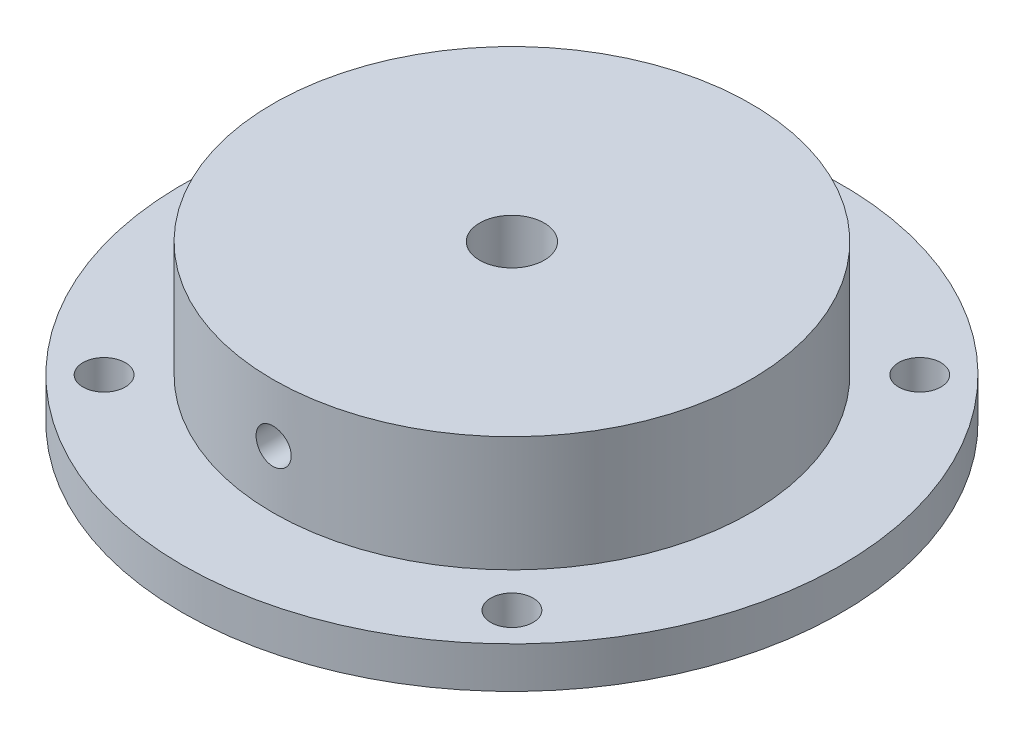
ISO-10303-21;
HEADER;
FILE_DESCRIPTION(('STEP AP214'),'2;1');
FILE_NAME('part.step','',(''),(''),'','','');
FILE_SCHEMA(('AUTOMOTIVE_DESIGN { 1 0 10303 214 1 1 1 1 }'));
ENDSEC;
DATA;
#1=APPLICATION_CONTEXT('core data for automotive mechanical design processes');
#2=APPLICATION_PROTOCOL_DEFINITION('international standard','automotive_design',2000,#1);
#3=PRODUCT_CONTEXT('',#1,'mechanical');
#4=PRODUCT('Part','Part','',(#3));
#5=PRODUCT_RELATED_PRODUCT_CATEGORY('part','',(#4));
#6=PRODUCT_DEFINITION_FORMATION('','',#4);
#7=PRODUCT_DEFINITION_CONTEXT('part definition',#1,'design');
#8=PRODUCT_DEFINITION('design','',#6,#7);
#9=PRODUCT_DEFINITION_SHAPE('','',#8);
#10=(LENGTH_UNIT() NAMED_UNIT(*) SI_UNIT(.MILLI.,.METRE.));
#11=(NAMED_UNIT(*) PLANE_ANGLE_UNIT() SI_UNIT($,.RADIAN.));
#12=(NAMED_UNIT(*) SI_UNIT($,.STERADIAN.) SOLID_ANGLE_UNIT());
#13=UNCERTAINTY_MEASURE_WITH_UNIT(LENGTH_MEASURE(1.E-05),#10,'distance_accuracy_value','');
#14=(GEOMETRIC_REPRESENTATION_CONTEXT(3) GLOBAL_UNCERTAINTY_ASSIGNED_CONTEXT((#13)) GLOBAL_UNIT_ASSIGNED_CONTEXT((#10,
#11,#12)) REPRESENTATION_CONTEXT('',''));
#15=CARTESIAN_POINT('',(0.,0.,0.));
#16=DIRECTION('',(0.,0.,1.));
#17=DIRECTION('',(1.,0.,0.));
#18=AXIS2_PLACEMENT_3D('',#15,#16,#17);
#19=CARTESIAN_POINT('',(0.,3.175,0.));
#20=DIRECTION('',(0.,-1.,0.));
#21=DIRECTION('',(0.,0.,-1.));
#22=AXIS2_PLACEMENT_3D('',#19,#20,#21);
#23=CYLINDRICAL_SURFACE('',#22,25.4);
#24=CARTESIAN_POINT('',(0.,3.175,0.));
#25=DIRECTION('',(0.,1.,0.));
#26=DIRECTION('',(0.,0.,1.));
#27=AXIS2_PLACEMENT_3D('',#24,#25,#26);
#28=CIRCLE('',#27,25.4);
#29=CARTESIAN_POINT('',(0.,3.175,25.4));
#30=VERTEX_POINT('',#29);
#31=EDGE_CURVE('E10',#30,#30,#28,.T.);
#32=ORIENTED_EDGE('',*,*,#31,.F.);
#33=EDGE_LOOP('',(#32));
#34=FACE_BOUND('',#33,.T.);
#35=CARTESIAN_POINT('',(0.,0.,0.));
#36=DIRECTION('',(0.,1.,0.));
#37=DIRECTION('',(0.,0.,1.));
#38=AXIS2_PLACEMENT_3D('',#35,#36,#37);
#39=CIRCLE('',#38,25.4);
#40=CARTESIAN_POINT('',(0.,0.,25.4));
#41=VERTEX_POINT('',#40);
#42=EDGE_CURVE('E43',#41,#41,#39,.T.);
#43=ORIENTED_EDGE('',*,*,#42,.T.);
#44=EDGE_LOOP('',(#43));
#45=FACE_BOUND('',#44,.T.);
#46=ADVANCED_FACE('F32',(#34,#45),#23,.T.);
#47=CARTESIAN_POINT('',(0.,3.175,0.));
#48=DIRECTION('',(0.,1.,0.));
#49=DIRECTION('',(0.,0.,1.));
#50=AXIS2_PLACEMENT_3D('',#47,#48,#49);
#51=PLANE('',#50);
#52=CARTESIAN_POINT('',(15.715448211871,3.175,15.715448211871));
#53=DIRECTION('',(0.,1.,0.));
#54=DIRECTION('',(0.,0.,1.));
#55=AXIS2_PLACEMENT_3D('',#52,#53,#54);
#56=CIRCLE('',#55,1.63194999999999);
#57=CARTESIAN_POINT('',(15.715448211871,3.175,17.347398211871));
#58=VERTEX_POINT('',#57);
#59=EDGE_CURVE('E139',#58,#58,#56,.T.);
#60=ORIENTED_EDGE('',*,*,#59,.F.);
#61=EDGE_LOOP('',(#60));
#62=FACE_BOUND('',#61,.T.);
#63=CARTESIAN_POINT('',(-15.715448211871,3.175,15.715448211871));
#64=DIRECTION('',(0.,1.,0.));
#65=DIRECTION('',(0.,0.,1.));
#66=AXIS2_PLACEMENT_3D('',#63,#64,#65);
#67=CIRCLE('',#66,1.63194999999999);
#68=CARTESIAN_POINT('',(-15.715448211871,3.175,17.347398211871));
#69=VERTEX_POINT('',#68);
#70=EDGE_CURVE('E135',#69,#69,#67,.T.);
#71=ORIENTED_EDGE('',*,*,#70,.F.);
#72=EDGE_LOOP('',(#71));
#73=FACE_BOUND('',#72,.T.);
#74=CARTESIAN_POINT('',(-15.715448211871,3.175,-15.715448211871));
#75=DIRECTION('',(0.,1.,0.));
#76=DIRECTION('',(0.,0.,1.));
#77=AXIS2_PLACEMENT_3D('',#74,#75,#76);
#78=CIRCLE('',#77,1.63194999999999);
#79=CARTESIAN_POINT('',(-15.715448211871,3.175,-14.083498211871));
#80=VERTEX_POINT('',#79);
#81=EDGE_CURVE('E129',#80,#80,#78,.T.);
#82=ORIENTED_EDGE('',*,*,#81,.F.);
#83=EDGE_LOOP('',(#82));
#84=FACE_BOUND('',#83,.T.);
#85=CARTESIAN_POINT('',(15.715448211871,3.175,-15.715448211871));
#86=DIRECTION('',(0.,1.,0.));
#87=DIRECTION('',(0.,0.,1.));
#88=AXIS2_PLACEMENT_3D('',#85,#86,#87);
#89=CIRCLE('',#88,1.63194999999999);
#90=CARTESIAN_POINT('',(15.715448211871,3.175,-14.083498211871));
#91=VERTEX_POINT('',#90);
#92=EDGE_CURVE('E67',#91,#91,#89,.T.);
#93=ORIENTED_EDGE('',*,*,#92,.F.);
#94=EDGE_LOOP('',(#93));
#95=FACE_BOUND('',#94,.T.);
#96=CARTESIAN_POINT('',(0.,3.175,0.));
#97=DIRECTION('',(0.,1.,0.));
#98=DIRECTION('',(0.,0.,1.));
#99=AXIS2_PLACEMENT_3D('',#96,#97,#98);
#100=CIRCLE('',#99,18.415);
#101=CARTESIAN_POINT('',(0.,3.175,18.415));
#102=VERTEX_POINT('',#101);
#103=EDGE_CURVE('E50',#102,#102,#100,.T.);
#104=ORIENTED_EDGE('',*,*,#103,.F.);
#105=EDGE_LOOP('',(#104));
#106=FACE_BOUND('',#105,.T.);
#107=ORIENTED_EDGE('',*,*,#31,.T.);
#108=EDGE_LOOP('',(#107));
#109=FACE_BOUND('',#108,.T.);
#110=ADVANCED_FACE('F96',(#62,#73,#84,#95,#106,#109),#51,.T.);
#111=CARTESIAN_POINT('',(0.,0.,0.));
#112=DIRECTION('',(0.,1.,0.));
#113=DIRECTION('',(0.,0.,1.));
#114=AXIS2_PLACEMENT_3D('',#111,#112,#113);
#115=PLANE('',#114);
#116=CARTESIAN_POINT('',(15.715448211871,0.,15.715448211871));
#117=DIRECTION('',(0.,-1.,0.));
#118=DIRECTION('',(0.,0.,-1.));
#119=AXIS2_PLACEMENT_3D('',#116,#117,#118);
#120=CIRCLE('',#119,1.63194999999999);
#121=CARTESIAN_POINT('',(15.715448211871,0.,14.083498211871));
#122=VERTEX_POINT('',#121);
#123=EDGE_CURVE('E112',#122,#122,#120,.T.);
#124=ORIENTED_EDGE('',*,*,#123,.F.);
#125=EDGE_LOOP('',(#124));
#126=FACE_BOUND('',#125,.T.);
#127=CARTESIAN_POINT('',(-15.715448211871,0.,15.715448211871));
#128=DIRECTION('',(0.,-1.,0.));
#129=DIRECTION('',(0.,0.,-1.));
#130=AXIS2_PLACEMENT_3D('',#127,#128,#129);
#131=CIRCLE('',#130,1.63194999999999);
#132=CARTESIAN_POINT('',(-15.715448211871,0.,14.083498211871));
#133=VERTEX_POINT('',#132);
#134=EDGE_CURVE('E116',#133,#133,#131,.T.);
#135=ORIENTED_EDGE('',*,*,#134,.F.);
#136=EDGE_LOOP('',(#135));
#137=FACE_BOUND('',#136,.T.);
#138=CARTESIAN_POINT('',(-15.715448211871,0.,-15.715448211871));
#139=DIRECTION('',(0.,-1.,0.));
#140=DIRECTION('',(0.,0.,-1.));
#141=AXIS2_PLACEMENT_3D('',#138,#139,#140);
#142=CIRCLE('',#141,1.63194999999999);
#143=CARTESIAN_POINT('',(-15.715448211871,0.,-17.347398211871));
#144=VERTEX_POINT('',#143);
#145=EDGE_CURVE('E120',#144,#144,#142,.T.);
#146=ORIENTED_EDGE('',*,*,#145,.F.);
#147=EDGE_LOOP('',(#146));
#148=FACE_BOUND('',#147,.T.);
#149=CARTESIAN_POINT('',(15.715448211871,0.,-15.715448211871));
#150=DIRECTION('',(0.,-1.,0.));
#151=DIRECTION('',(0.,0.,-1.));
#152=AXIS2_PLACEMENT_3D('',#149,#150,#151);
#153=CIRCLE('',#152,1.63194999999999);
#154=CARTESIAN_POINT('',(15.715448211871,0.,-17.347398211871));
#155=VERTEX_POINT('',#154);
#156=EDGE_CURVE('E124',#155,#155,#153,.T.);
#157=ORIENTED_EDGE('',*,*,#156,.F.);
#158=EDGE_LOOP('',(#157));
#159=FACE_BOUND('',#158,.T.);
#160=CARTESIAN_POINT('',(0.,0.,0.));
#161=DIRECTION('',(0.,1.,0.));
#162=DIRECTION('',(0.,0.,1.));
#163=AXIS2_PLACEMENT_3D('',#160,#161,#162);
#164=CIRCLE('',#163,2.4892);
#165=CARTESIAN_POINT('',(0.,0.,2.4892));
#166=VERTEX_POINT('',#165);
#167=EDGE_CURVE('E53',#166,#166,#164,.T.);
#168=ORIENTED_EDGE('',*,*,#167,.T.);
#169=EDGE_LOOP('',(#168));
#170=FACE_BOUND('',#169,.T.);
#171=ORIENTED_EDGE('',*,*,#42,.F.);
#172=EDGE_LOOP('',(#171));
#173=FACE_BOUND('',#172,.T.);
#174=ADVANCED_FACE('F91',(#126,#137,#148,#159,#170,#173),#115,.F.);
#175=CARTESIAN_POINT('',(0.,12.065,0.));
#176=DIRECTION('',(0.,-1.,0.));
#177=DIRECTION('',(0.,0.,-1.));
#178=AXIS2_PLACEMENT_3D('',#175,#176,#177);
#179=CYLINDRICAL_SURFACE('',#178,18.415);
#180=CARTESIAN_POINT('',(-1.35255,7.62,18.3652615962175));
#181=CARTESIAN_POINT('',(-1.35254667324869,7.69586331050199,18.3652622585377));
#182=CARTESIAN_POINT('',(-1.34614588239744,7.7717790194342,18.3657367187505));
#183=CARTESIAN_POINT('',(-1.32070491357549,7.92151212719887,18.3675833989998));
#184=CARTESIAN_POINT('',(-1.30165021505754,7.99532701370732,18.3689566503864));
#185=CARTESIAN_POINT('',(-1.25145355780686,8.13866803065204,18.3724445358624));
#186=CARTESIAN_POINT('',(-1.22031821070884,8.20819648293678,18.3745587643602));
#187=CARTESIAN_POINT('',(-1.14685530849389,8.34102295619462,18.3792898713083));
#188=CARTESIAN_POINT('',(-1.104530232738,8.40432235311067,18.3819066383735));
#189=CARTESIAN_POINT('',(-1.00979622217114,8.52303939510487,18.3873539419724));
#190=CARTESIAN_POINT('',(-0.957369360579333,8.57844271899893,18.3901848530217));
#191=CARTESIAN_POINT('',(-0.843957549825231,8.67967208741654,18.3957380165563));
#192=CARTESIAN_POINT('',(-0.782972235665779,8.72549772326743,18.3984602644009));
#193=CARTESIAN_POINT('',(-0.654091209210795,8.80631698831384,18.4034927903813));
#194=CARTESIAN_POINT('',(-0.586187853403721,8.84129845987202,18.405802604908));
#195=CARTESIAN_POINT('',(-0.44545172718761,8.89935861093207,18.4097460094622));
#196=CARTESIAN_POINT('',(-0.372619025957564,8.92243745743755,18.4113796089774));
#197=CARTESIAN_POINT('',(-0.224232280407396,8.95599665152316,18.4137839147185));
#198=CARTESIAN_POINT('',(-0.148683431531067,8.96649985757495,18.4145561863859));
#199=CARTESIAN_POINT('',(0.00310859661012197,8.97468025071885,18.4151561118048));
#200=CARTESIAN_POINT('',(0.0793517655375517,8.97235762845848,18.4149837795972));
#201=CARTESIAN_POINT('',(0.230213262752939,8.95497106825203,18.4137152132697));
#202=CARTESIAN_POINT('',(0.304834441360394,8.9399317141282,18.4126207617933));
#203=CARTESIAN_POINT('',(0.450490377744667,8.8975767897358,18.4096331672967));
#204=CARTESIAN_POINT('',(0.521525107918341,8.87026112499847,18.4077400181303));
#205=CARTESIAN_POINT('',(0.658070318098324,8.80410134727081,18.4033650270283));
#206=CARTESIAN_POINT('',(0.723575412269808,8.7652461575006,18.4008826199261));
#207=CARTESIAN_POINT('',(0.847143103587002,8.67711833411986,18.3956082908501));
#208=CARTESIAN_POINT('',(0.905205583998538,8.62784553714578,18.392816364023));
#209=CARTESIAN_POINT('',(1.01238347708563,8.52014246972719,18.3872292074706));
#210=CARTESIAN_POINT('',(1.06147743861575,8.46169084980182,18.384433985514));
#211=CARTESIAN_POINT('',(1.14915914231379,8.33736396548088,18.3791619473192));
#212=CARTESIAN_POINT('',(1.1877468783604,8.27148869676004,18.3766851312665));
#213=CARTESIAN_POINT('',(1.25331958854227,8.13417013591135,18.3723297467562));
#214=CARTESIAN_POINT('',(1.28030355648321,8.06272636155745,18.3704512301824));
#215=CARTESIAN_POINT('',(1.3218874212351,7.91630552238832,18.3675060092211));
#216=CARTESIAN_POINT('',(1.33648751970953,7.84132851513054,18.3664392916138));
#217=CARTESIAN_POINT('',(1.35286226664552,7.69015693547319,18.3652404647005));
#218=CARTESIAN_POINT('',(1.35466678022875,7.61396561454782,18.3651061790968));
#219=CARTESIAN_POINT('',(1.345477262916,7.46236350755746,18.3657816696346));
#220=CARTESIAN_POINT('',(1.33448332441361,7.38695271586171,18.366591438961));
#221=CARTESIAN_POINT('',(1.30003383251902,7.23913738310574,18.3690618063194));
#222=CARTESIAN_POINT('',(1.27659212317696,7.16672959845022,18.3707214590629));
#223=CARTESIAN_POINT('',(1.21792656024579,7.02687537668614,18.3747037874263));
#224=CARTESIAN_POINT('',(1.18270255930721,6.95942900163789,18.3770264713382));
#225=CARTESIAN_POINT('',(1.10139634029233,6.83127522229771,18.3820784171012));
#226=CARTESIAN_POINT('',(1.05529416466073,6.77058050968824,18.3848084228164));
#227=CARTESIAN_POINT('',(0.953569204416953,6.65778101247418,18.3903648326367));
#228=CARTESIAN_POINT('',(0.897946292106689,6.60567634310303,18.3931912380344));
#229=CARTESIAN_POINT('',(0.778629995652756,6.5114345919472,18.3986283953872));
#230=CARTESIAN_POINT('',(0.714921294645707,6.46931687444155,18.4012387221013));
#231=CARTESIAN_POINT('',(0.581318548608257,6.39637727357496,18.4059434883154));
#232=CARTESIAN_POINT('',(0.511424553428428,6.36555529918593,18.4080379319726));
#233=CARTESIAN_POINT('',(0.367505557813339,6.31611558292562,18.4114729538777));
#234=CARTESIAN_POINT('',(0.293484738585048,6.29748572363717,18.4128142804394));
#235=CARTESIAN_POINT('',(0.1433555323735,6.27291944049834,18.4145949493448));
#236=CARTESIAN_POINT('',(0.0672471752321156,6.26698283529043,18.4150343045755));
#237=CARTESIAN_POINT('',(-0.0847054100423964,6.26797349565314,18.4149615580399));
#238=CARTESIAN_POINT('',(-0.160549838249069,6.27487051997418,18.414451693021));
#239=CARTESIAN_POINT('',(-0.31000036495643,6.30126977721424,18.4125422449387));
#240=CARTESIAN_POINT('',(-0.383606459911748,6.32077203009801,18.4111426604661));
#241=CARTESIAN_POINT('',(-0.526494113533272,6.37182086537175,18.407610943451));
#242=CARTESIAN_POINT('',(-0.595775796371724,6.40336710174249,18.4054788319538));
#243=CARTESIAN_POINT('',(-0.728064033290403,6.4776046840557,18.4007210276901));
#244=CARTESIAN_POINT('',(-0.791070718808166,6.52029579648717,18.3980953452654));
#245=CARTESIAN_POINT('',(-0.909174739092622,6.61572430280761,18.3926380726705));
#246=CARTESIAN_POINT('',(-0.964254118359509,6.66848389280607,18.3898060362807));
#247=CARTESIAN_POINT('',(-1.06479552124027,6.78251538892751,18.3842589764997));
#248=CARTESIAN_POINT('',(-1.11025520034196,6.84378936416112,18.3815439817619));
#249=CARTESIAN_POINT('',(-1.19031389290679,6.97320400254798,18.3765337953426));
#250=CARTESIAN_POINT('',(-1.22489599692593,7.04135514134031,18.3742392595628));
#251=CARTESIAN_POINT('',(-1.2820832929911,7.18246531141354,18.3703379576189));
#252=CARTESIAN_POINT('',(-1.3047023865808,7.25541865093337,18.3687303935825));
#253=CARTESIAN_POINT('',(-1.33150035790105,7.37734222264709,18.3668025127521));
#254=CARTESIAN_POINT('',(-1.33938362715936,7.42552620056215,18.3662272873667));
#255=CARTESIAN_POINT('',(-1.3499095124613,7.52246623243099,18.365456616554));
#256=CARTESIAN_POINT('',(-1.3525521389961,7.57122228523935,18.3652611703665));
#257=CARTESIAN_POINT('',(-1.35255,7.62,18.3652615962175));
#258=B_SPLINE_CURVE_WITH_KNOTS('',3,(#180,#181,#182,#183,#184,#185,#186,#187,#188,#189,#190,
#191,#192,#193,#194,#195,#196,#197,#198,#199,#200,#201,#202,#203,#204,#205,#206,#207,#208,#209,
#210,#211,#212,#213,#214,#215,#216,#217,#218,#219,#220,#221,#222,#223,#224,#225,#226,#227,#228,
#229,#230,#231,#232,#233,#234,#235,#236,#237,#238,#239,#240,#241,#242,#243,#244,#245,#246,#247,
#248,#249,#250,#251,#252,#253,#254,#255,#256,#257),.UNSPECIFIED.,.T.,.F.,(4,2,2,2,2,2,2,2,2,2,2,
2,2,2,2,2,2,2,2,2,2,2,2,2,2,2,2,2,2,2,2,2,2,2,2,2,2,2,4),(0.,0.227411849272525,0.45508510899637,
0.682633940468655,0.910132395066739,1.13803835332969,1.36595403418207,1.59412431998186,
1.82229140427787,2.05004312146835,2.27779145328797,2.50510050891645,2.73241131376518,
2.95994102319565,3.18747430089454,3.41554487002724,3.64361557204198,3.87170604670236,
4.09979280698235,4.32734703296956,4.55489961622496,4.78219965052117,5.00950252754021,
5.23722571164109,5.46495195034759,5.6931161946006,5.92127860012418,6.14921389536,
6.37714593390069,6.60454155192705,6.83193753011422,7.05932697579005,7.28671165751212,
7.51460352705461,7.74255087456917,7.97085084004887,8.19888492478922,8.34510386052864,
8.49132250355393),.UNSPECIFIED.);
#259=CARTESIAN_POINT('',(-1.35255,7.62,18.3652615962175));
#260=VERTEX_POINT('',#259);
#261=EDGE_CURVE('E61',#260,#260,#258,.T.);
#262=ORIENTED_EDGE('',*,*,#261,.T.);
#263=EDGE_LOOP('',(#262));
#264=FACE_BOUND('',#263,.T.);
#265=CARTESIAN_POINT('',(0.,12.065,0.));
#266=DIRECTION('',(0.,1.,0.));
#267=DIRECTION('',(0.,0.,1.));
#268=AXIS2_PLACEMENT_3D('',#265,#266,#267);
#269=CIRCLE('',#268,18.415);
#270=CARTESIAN_POINT('',(0.,12.065,18.415));
#271=VERTEX_POINT('',#270);
#272=EDGE_CURVE('E48',#271,#271,#269,.T.);
#273=ORIENTED_EDGE('',*,*,#272,.F.);
#274=EDGE_LOOP('',(#273));
#275=FACE_BOUND('',#274,.T.);
#276=ORIENTED_EDGE('',*,*,#103,.T.);
#277=EDGE_LOOP('',(#276));
#278=FACE_BOUND('',#277,.T.);
#279=ADVANCED_FACE('F69',(#264,#275,#278),#179,.T.);
#280=CARTESIAN_POINT('',(0.,12.065,0.));
#281=DIRECTION('',(0.,1.,0.));
#282=DIRECTION('',(0.,0.,1.));
#283=AXIS2_PLACEMENT_3D('',#280,#281,#282);
#284=PLANE('',#283);
#285=CARTESIAN_POINT('',(0.,12.065,0.));
#286=DIRECTION('',(0.,1.,0.));
#287=DIRECTION('',(0.,0.,1.));
#288=AXIS2_PLACEMENT_3D('',#285,#286,#287);
#289=CIRCLE('',#288,2.48919999999999);
#290=CARTESIAN_POINT('',(0.,12.065,2.48919999999999));
#291=VERTEX_POINT('',#290);
#292=EDGE_CURVE('E58',#291,#291,#289,.T.);
#293=ORIENTED_EDGE('',*,*,#292,.F.);
#294=EDGE_LOOP('',(#293));
#295=FACE_BOUND('',#294,.T.);
#296=ORIENTED_EDGE('',*,*,#272,.T.);
#297=EDGE_LOOP('',(#296));
#298=FACE_BOUND('',#297,.T.);
#299=ADVANCED_FACE('F84',(#295,#298),#284,.T.);
#300=CARTESIAN_POINT('',(0.,12.065,0.));
#301=DIRECTION('',(0.,1.,0.));
#302=DIRECTION('',(0.,0.,1.));
#303=AXIS2_PLACEMENT_3D('',#300,#301,#302);
#304=CYLINDRICAL_SURFACE('',#303,2.48919999999999);
#305=CARTESIAN_POINT('',(0.,6.26745,2.48919999999999));
#306=CARTESIAN_POINT('',(0.0703458169969837,6.26745449949587,2.48919595635754));
#307=CARTESIAN_POINT('',(0.140752247831416,6.27296979869797,2.48618742915147));
#308=CARTESIAN_POINT('',(0.279436492377327,6.29476384630136,2.47444842061267));
#309=CARTESIAN_POINT('',(0.347711095676724,6.31105807898485,2.4657097078438));
#310=CARTESIAN_POINT('',(0.479924429067063,6.35356126552815,2.44341303015242));
#311=CARTESIAN_POINT('',(0.54387965585679,6.37972964796847,2.4298747993201));
#312=CARTESIAN_POINT('',(0.666368684406417,6.44100084137688,2.39917950928813));
#313=CARTESIAN_POINT('',(0.724902334981475,6.47610390139311,2.38202234921553));
#314=CARTESIAN_POINT('',(0.839343982826095,6.55692517831971,2.34424632388435));
#315=CARTESIAN_POINT('',(0.894805672836866,6.60320130594504,2.32347170788974));
#316=CARTESIAN_POINT('',(0.997602059821432,6.70383232237269,2.28122801570182));
#317=CARTESIAN_POINT('',(1.04492935165065,6.75819448920858,2.25975832765445));
#318=CARTESIAN_POINT('',(1.13467890193291,6.87964415295146,2.21615441732712));
#319=CARTESIAN_POINT('',(1.17620008573188,6.9474512911803,2.19415278920114));
#320=CARTESIAN_POINT('',(1.24708580166542,7.0903625596368,2.15465762879415));
#321=CARTESIAN_POINT('',(1.27645987003044,7.16546090840233,2.13716056424356));
#322=CARTESIAN_POINT('',(1.32014787822114,7.3161057717618,2.11043831073532));
#323=CARTESIAN_POINT('',(1.33529366330495,7.3913262980818,2.10076163023955));
#324=CARTESIAN_POINT('',(1.35257211719016,7.54380716494871,2.08968513226561));
#325=CARTESIAN_POINT('',(1.35472252079317,7.62106458097603,2.08827403482427));
#326=CARTESIAN_POINT('',(1.34655566851597,7.76310810901584,2.09353997785434));
#327=CARTESIAN_POINT('',(1.33803125617149,7.82805234094552,2.09905429774383));
#328=CARTESIAN_POINT('',(1.31191962845963,7.9553870026604,2.11547140230956));
#329=CARTESIAN_POINT('',(1.29432848656199,8.01777631333881,2.12637652149652));
#330=CARTESIAN_POINT('',(1.25033539175913,8.13996763395461,2.1525430102513));
#331=CARTESIAN_POINT('',(1.22374841321184,8.19968272452895,2.16789479546866));
#332=CARTESIAN_POINT('',(1.16267509932659,8.31411036407189,2.20125264752762));
#333=CARTESIAN_POINT('',(1.12818531225756,8.36882071245229,2.21925987296445));
#334=CARTESIAN_POINT('',(1.04613935750034,8.48051935870108,2.25922423472035));
#335=CARTESIAN_POINT('',(0.99739039737635,8.53656962663524,2.2813635441025));
#336=CARTESIAN_POINT('',(0.891195920486835,8.64013059117252,2.32490482504709));
#337=CARTESIAN_POINT('',(0.833744760169964,8.68763570201426,2.34630630697565));
#338=CARTESIAN_POINT('',(0.707187142898507,8.77567647046662,2.38761507130813));
#339=CARTESIAN_POINT('',(0.637570073144511,8.81557152104497,2.4073390706066));
#340=CARTESIAN_POINT('',(0.491280414195339,8.88273330442349,2.44138892464724));
#341=CARTESIAN_POINT('',(0.414614404428207,8.91001167293486,2.45571975095056));
#342=CARTESIAN_POINT('',(0.263935156209106,8.94861245988548,2.47622611752603));
#343=CARTESIAN_POINT('',(0.190325251366392,8.96117049560709,2.48302991836545));
#344=CARTESIAN_POINT('',(0.0417459100605424,8.97395640255803,2.48995807190855));
#345=CARTESIAN_POINT('',(-0.0332226631712522,8.97419184595947,2.49008652657913));
#346=CARTESIAN_POINT('',(-0.174786092528664,8.96290784093222,2.48397078085945));
#347=CARTESIAN_POINT('',(-0.241500423618623,8.95250185746619,2.47833021358012));
#348=CARTESIAN_POINT('',(-0.37206787515307,8.92209487695353,2.46211516140844));
#349=CARTESIAN_POINT('',(-0.435920702205787,8.90209289847349,2.45154017184953));
#350=CARTESIAN_POINT('',(-0.56074176166381,8.85270978210242,2.42607531864313));
#351=CARTESIAN_POINT('',(-0.621606939534889,8.82311927455733,2.4110898930041));
#352=CARTESIAN_POINT('',(-0.737673911232848,8.75566707362134,2.37815035291498));
#353=CARTESIAN_POINT('',(-0.792873565409597,8.71780227211762,2.360195123521));
#354=CARTESIAN_POINT('',(-0.902525138791924,8.63009790770534,2.32063029348538));
#355=CARTESIAN_POINT('',(-0.956223165112821,8.57939823618395,2.29883605716541));
#356=CARTESIAN_POINT('',(-1.05475100357994,8.4698969068587,2.25533230550213));
#357=CARTESIAN_POINT('',(-1.09957197489456,8.41108727004905,2.23362289551668));
#358=CARTESIAN_POINT('',(-1.18229194706407,8.28173489836912,2.19103240440704));
#359=CARTESIAN_POINT('',(-1.21944005711636,8.21064748700746,2.17032948269888));
#360=CARTESIAN_POINT('',(-1.28088095748204,8.06180633397442,2.13465150903004));
#361=CARTESIAN_POINT('',(-1.30519235368668,7.98406243154785,2.11966817572003));
#362=CARTESIAN_POINT('',(-1.33784698713277,7.83210864076186,2.09919567379112));
#363=CARTESIAN_POINT('',(-1.34751630478283,7.75829354467204,2.09292308666779));
#364=CARTESIAN_POINT('',(-1.35454654819495,7.60985623325911,2.08838327471234));
#365=CARTESIAN_POINT('',(-1.35191711207562,7.53523469565919,2.09010978125021));
#366=CARTESIAN_POINT('',(-1.33571073597535,7.39766319053361,2.10049030973011));
#367=CARTESIAN_POINT('',(-1.32360383528871,7.33445863858036,2.1082130379484));
#368=CARTESIAN_POINT('',(-1.29084270809285,7.21110973540448,2.12842900854001));
#369=CARTESIAN_POINT('',(-1.27018511916678,7.15096659849225,2.14092412742757));
#370=CARTESIAN_POINT('',(-1.21951270841104,7.03121170241449,2.17020958299422));
#371=CARTESIAN_POINT('',(-1.18899257566019,6.9718694900946,2.18722003668212));
#372=CARTESIAN_POINT('',(-1.11994945402672,6.85875024946921,2.22336419484242));
#373=CARTESIAN_POINT('',(-1.08142218155141,6.80497622314986,2.24249903323767));
#374=CARTESIAN_POINT('',(-0.990634519976389,6.6959875566579,2.28421017437249));
#375=CARTESIAN_POINT('',(-0.937176916293302,6.64179571157878,2.30686758823897));
#376=CARTESIAN_POINT('',(-0.821501964121687,6.54281755957001,2.3505474857472));
#377=CARTESIAN_POINT('',(-0.759278632174307,6.49803772972086,2.37156883727349));
#378=CARTESIAN_POINT('',(-0.625250325457722,6.41803220926805,2.41043391779507));
#379=CARTESIAN_POINT('',(-0.5532114345337,6.38313864162204,2.42816151348504));
#380=CARTESIAN_POINT('',(-0.403095897755135,6.32643798236511,2.45752605778315));
#381=CARTESIAN_POINT('',(-0.325035609046928,6.30459675577082,2.46917888307256));
#382=CARTESIAN_POINT('',(-0.20504953558427,6.28245086835106,2.48107432737666));
#383=CARTESIAN_POINT('',(-0.164310407384179,6.27683717871193,2.4841099095082));
#384=CARTESIAN_POINT('',(-0.0823877842279835,6.26933543032973,2.48817392816235));
#385=CARTESIAN_POINT('',(-0.0412042901208917,6.26744736446969,2.48920236851917));
#386=CARTESIAN_POINT('',(0.,6.26745,2.48919999999999));
#387=B_SPLINE_CURVE_WITH_KNOTS('',3,(#305,#306,#307,#308,#309,#310,#311,#312,#313,#314,#315,
#316,#317,#318,#319,#320,#321,#322,#323,#324,#325,#326,#327,#328,#329,#330,#331,#332,#333,#334,
#335,#336,#337,#338,#339,#340,#341,#342,#343,#344,#345,#346,#347,#348,#349,#350,#351,#352,#353,
#354,#355,#356,#357,#358,#359,#360,#361,#362,#363,#364,#365,#366,#367,#368,#369,#370,#371,#372,
#373,#374,#375,#376,#377,#378,#379,#380,#381,#382,#383,#384,#385,#386),.UNSPECIFIED.,.T.,.F.,(4,
2,2,2,2,2,2,2,2,2,2,2,2,2,2,2,2,2,2,2,2,2,2,2,2,2,2,2,2,2,2,2,2,2,2,2,2,2,2,2,4),(0.,
0.210871428658044,0.422046440595896,0.632363050736528,0.842685523953771,1.06725228635551,
1.29202241245727,1.53827431707237,1.78433253014158,2.01489681200162,2.24514637152159,
2.44142150289883,2.637781706694,2.83845455250317,3.03921521437449,3.27077321966301,
3.50248204304989,3.74901989540454,3.99532992308112,4.21901198366091,4.44255659110442,
4.64488593462337,4.84723597585258,5.05434137494109,5.26152470416746,5.49155801022361,
5.72181927148268,5.96900459708148,6.21583065499286,6.43858468391838,6.66116417728343,
6.8547619074224,7.04843583910172,7.25424807191364,7.46017069316401,7.69738489416197,
7.93476180855907,8.17936065363198,8.42331698273413,8.54683284328739,8.67034846789099),.UNSPECIFIED.);
#388=CARTESIAN_POINT('',(0.,6.26745,2.48919999999999));
#389=VERTEX_POINT('',#388);
#390=EDGE_CURVE('E35',#389,#389,#387,.T.);
#391=ORIENTED_EDGE('',*,*,#390,.T.);
#392=EDGE_LOOP('',(#391));
#393=FACE_BOUND('',#392,.T.);
#394=ORIENTED_EDGE('',*,*,#167,.F.);
#395=EDGE_LOOP('',(#394));
#396=FACE_BOUND('',#395,.T.);
#397=ORIENTED_EDGE('',*,*,#292,.T.);
#398=EDGE_LOOP('',(#397));
#399=FACE_BOUND('',#398,.T.);
#400=ADVANCED_FACE('F78',(#393,#396,#399),#304,.F.);
#401=CARTESIAN_POINT('',(0.,7.62,0.));
#402=DIRECTION('',(0.,0.,-1.));
#403=DIRECTION('',(-1.,0.,0.));
#404=AXIS2_PLACEMENT_3D('',#401,#402,#403);
#405=CYLINDRICAL_SURFACE('',#404,1.35255);
#406=ORIENTED_EDGE('',*,*,#390,.F.);
#407=EDGE_LOOP('',(#406));
#408=FACE_BOUND('',#407,.T.);
#409=ORIENTED_EDGE('',*,*,#261,.F.);
#410=EDGE_LOOP('',(#409));
#411=FACE_BOUND('',#410,.T.);
#412=ADVANCED_FACE('F73',(#408,#411),#405,.F.);
#413=CARTESIAN_POINT('',(15.715448211871,0.,-15.715448211871));
#414=DIRECTION('',(0.,-1.,0.));
#415=DIRECTION('',(0.,0.,-1.));
#416=AXIS2_PLACEMENT_3D('',#413,#414,#415);
#417=CYLINDRICAL_SURFACE('',#416,1.63194999999999);
#418=ORIENTED_EDGE('',*,*,#92,.T.);
#419=EDGE_LOOP('',(#418));
#420=FACE_BOUND('',#419,.T.);
#421=ORIENTED_EDGE('',*,*,#156,.T.);
#422=EDGE_LOOP('',(#421));
#423=FACE_BOUND('',#422,.T.);
#424=ADVANCED_FACE('F77',(#420,#423),#417,.F.);
#425=CARTESIAN_POINT('',(-15.715448211871,0.,-15.715448211871));
#426=DIRECTION('',(0.,-1.,0.));
#427=DIRECTION('',(0.,0.,-1.));
#428=AXIS2_PLACEMENT_3D('',#425,#426,#427);
#429=CYLINDRICAL_SURFACE('',#428,1.63194999999999);
#430=ORIENTED_EDGE('',*,*,#81,.T.);
#431=EDGE_LOOP('',(#430));
#432=FACE_BOUND('',#431,.T.);
#433=ORIENTED_EDGE('',*,*,#145,.T.);
#434=EDGE_LOOP('',(#433));
#435=FACE_BOUND('',#434,.T.);
#436=ADVANCED_FACE('F151',(#432,#435),#429,.F.);
#437=CARTESIAN_POINT('',(-15.715448211871,0.,15.715448211871));
#438=DIRECTION('',(0.,-1.,0.));
#439=DIRECTION('',(0.,0.,-1.));
#440=AXIS2_PLACEMENT_3D('',#437,#438,#439);
#441=CYLINDRICAL_SURFACE('',#440,1.63194999999999);
#442=ORIENTED_EDGE('',*,*,#70,.T.);
#443=EDGE_LOOP('',(#442));
#444=FACE_BOUND('',#443,.T.);
#445=ORIENTED_EDGE('',*,*,#134,.T.);
#446=EDGE_LOOP('',(#445));
#447=FACE_BOUND('',#446,.T.);
#448=ADVANCED_FACE('F145',(#444,#447),#441,.F.);
#449=CARTESIAN_POINT('',(15.715448211871,0.,15.715448211871));
#450=DIRECTION('',(0.,-1.,0.));
#451=DIRECTION('',(0.,0.,-1.));
#452=AXIS2_PLACEMENT_3D('',#449,#450,#451);
#453=CYLINDRICAL_SURFACE('',#452,1.63194999999999);
#454=ORIENTED_EDGE('',*,*,#59,.T.);
#455=EDGE_LOOP('',(#454));
#456=FACE_BOUND('',#455,.T.);
#457=ORIENTED_EDGE('',*,*,#123,.T.);
#458=EDGE_LOOP('',(#457));
#459=FACE_BOUND('',#458,.T.);
#460=ADVANCED_FACE('F143',(#456,#459),#453,.F.);
#461=CLOSED_SHELL('',(#46,#110,#174,#279,#299,#400,#412,#424,#436,#448,#460));
#462=MANIFOLD_SOLID_BREP('B2',#461);
#463=ADVANCED_BREP_SHAPE_REPRESENTATION('',(#18,#462),#14);
#464=SHAPE_DEFINITION_REPRESENTATION(#9,#463);
ENDSEC;
END-ISO-10303-21;
